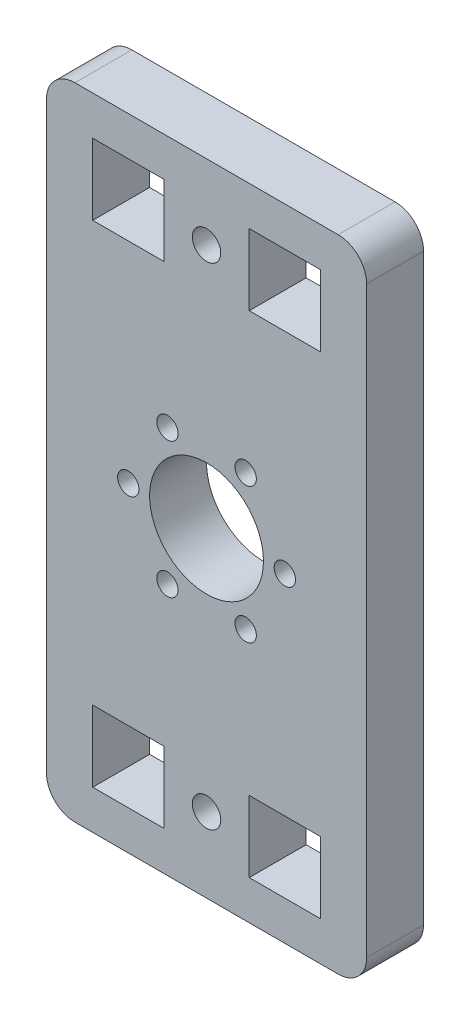
ISO-10303-21;
HEADER;
FILE_DESCRIPTION(('STEP AP214'),'2;1');
FILE_NAME('part.step','',(''),(''),'','','');
FILE_SCHEMA(('AUTOMOTIVE_DESIGN { 1 0 10303 214 1 1 1 1 }'));
ENDSEC;
DATA;
#1=APPLICATION_CONTEXT('core data for automotive mechanical design processes');
#2=APPLICATION_PROTOCOL_DEFINITION('international standard','automotive_design',2000,#1);
#3=PRODUCT_CONTEXT('',#1,'mechanical');
#4=PRODUCT('Part','Part','',(#3));
#5=PRODUCT_RELATED_PRODUCT_CATEGORY('part','',(#4));
#6=PRODUCT_DEFINITION_FORMATION('','',#4);
#7=PRODUCT_DEFINITION_CONTEXT('part definition',#1,'design');
#8=PRODUCT_DEFINITION('design','',#6,#7);
#9=PRODUCT_DEFINITION_SHAPE('','',#8);
#10=(LENGTH_UNIT() NAMED_UNIT(*) SI_UNIT(.MILLI.,.METRE.));
#11=(NAMED_UNIT(*) PLANE_ANGLE_UNIT() SI_UNIT($,.RADIAN.));
#12=(NAMED_UNIT(*) SI_UNIT($,.STERADIAN.) SOLID_ANGLE_UNIT());
#13=UNCERTAINTY_MEASURE_WITH_UNIT(LENGTH_MEASURE(1.E-05),#10,'distance_accuracy_value','');
#14=(GEOMETRIC_REPRESENTATION_CONTEXT(3) GLOBAL_UNCERTAINTY_ASSIGNED_CONTEXT((#13)) GLOBAL_UNIT_ASSIGNED_CONTEXT((#10,
#11,#12)) REPRESENTATION_CONTEXT('',''));
#15=CARTESIAN_POINT('',(0.,0.,0.));
#16=DIRECTION('',(0.,0.,1.));
#17=DIRECTION('',(1.,0.,0.));
#18=AXIS2_PLACEMENT_3D('',#15,#16,#17);
#19=CARTESIAN_POINT('',(18.5,-41.,8.));
#20=DIRECTION('',(0.,0.,1.));
#21=DIRECTION('',(1.,0.,0.));
#22=AXIS2_PLACEMENT_3D('',#19,#20,#21);
#23=PLANE('',#22);
#24=DIRECTION('',(0.,1.,0.));
#25=VECTOR('',#24,1.);
#26=CARTESIAN_POINT('',(16.,29.5,8.));
#27=LINE('',#26,#25);
#28=CARTESIAN_POINT('',(16.,29.5,8.));
#29=VERTEX_POINT('',#28);
#30=CARTESIAN_POINT('',(16.,39.5,8.));
#31=VERTEX_POINT('',#30);
#32=EDGE_CURVE('E246',#29,#31,#27,.T.);
#33=ORIENTED_EDGE('',*,*,#32,.F.);
#34=DIRECTION('',(1.,0.,0.));
#35=VECTOR('',#34,1.);
#36=CARTESIAN_POINT('',(16.,29.5,8.));
#37=LINE('',#36,#35);
#38=CARTESIAN_POINT('',(6.00000000000001,29.5,8.));
#39=VERTEX_POINT('',#38);
#40=EDGE_CURVE('E244',#39,#29,#37,.T.);
#41=ORIENTED_EDGE('',*,*,#40,.F.);
#42=DIRECTION('',(0.,-1.,0.));
#43=VECTOR('',#42,1.);
#44=CARTESIAN_POINT('',(6.00000000000001,29.5,8.));
#45=LINE('',#44,#43);
#46=CARTESIAN_POINT('',(6.00000000000001,39.5,8.));
#47=VERTEX_POINT('',#46);
#48=EDGE_CURVE('E252',#47,#39,#45,.T.);
#49=ORIENTED_EDGE('',*,*,#48,.F.);
#50=DIRECTION('',(-1.,0.,0.));
#51=VECTOR('',#50,1.);
#52=CARTESIAN_POINT('',(16.,39.5,8.));
#53=LINE('',#52,#51);
#54=EDGE_CURVE('E249',#31,#47,#53,.T.);
#55=ORIENTED_EDGE('',*,*,#54,.F.);
#56=EDGE_LOOP('',(#33,#41,#49,#55));
#57=FACE_BOUND('',#56,.T.);
#58=CARTESIAN_POINT('',(0.,-34.5,8.));
#59=DIRECTION('',(0.,0.,1.));
#60=DIRECTION('',(1.,0.,0.));
#61=AXIS2_PLACEMENT_3D('',#58,#59,#60);
#62=CIRCLE('',#61,2.00000000000001);
#63=CARTESIAN_POINT('',(2.00000000000001,-34.5,8.));
#64=VERTEX_POINT('',#63);
#65=EDGE_CURVE('E275',#64,#64,#62,.T.);
#66=ORIENTED_EDGE('',*,*,#65,.F.);
#67=EDGE_LOOP('',(#66));
#68=FACE_BOUND('',#67,.T.);
#69=CARTESIAN_POINT('',(5.50000000000001,-9.52627944162882,8.));
#70=DIRECTION('',(0.,0.,1.));
#71=DIRECTION('',(1.,0.,0.));
#72=AXIS2_PLACEMENT_3D('',#69,#70,#71);
#73=CIRCLE('',#72,1.5);
#74=CARTESIAN_POINT('',(7.,-9.52627944162882,8.));
#75=VERTEX_POINT('',#74);
#76=EDGE_CURVE('E287',#75,#75,#73,.T.);
#77=ORIENTED_EDGE('',*,*,#76,.F.);
#78=EDGE_LOOP('',(#77));
#79=FACE_BOUND('',#78,.T.);
#80=CARTESIAN_POINT('',(5.5,9.52627944162883,8.));
#81=DIRECTION('',(0.,0.,1.));
#82=DIRECTION('',(1.,0.,0.));
#83=AXIS2_PLACEMENT_3D('',#80,#81,#82);
#84=CIRCLE('',#83,1.5);
#85=CARTESIAN_POINT('',(7.,9.52627944162883,8.));
#86=VERTEX_POINT('',#85);
#87=EDGE_CURVE('E299',#86,#86,#84,.T.);
#88=ORIENTED_EDGE('',*,*,#87,.F.);
#89=EDGE_LOOP('',(#88));
#90=FACE_BOUND('',#89,.T.);
#91=CARTESIAN_POINT('',(0.,0.,8.));
#92=DIRECTION('',(0.,0.,1.));
#93=DIRECTION('',(1.,0.,0.));
#94=AXIS2_PLACEMENT_3D('',#91,#92,#93);
#95=CIRCLE('',#94,8.);
#96=CARTESIAN_POINT('',(8.,0.,8.));
#97=VERTEX_POINT('',#96);
#98=EDGE_CURVE('E311',#97,#97,#95,.T.);
#99=ORIENTED_EDGE('',*,*,#98,.F.);
#100=EDGE_LOOP('',(#99));
#101=FACE_BOUND('',#100,.T.);
#102=DIRECTION('',(-1.,0.,0.));
#103=VECTOR('',#102,1.);
#104=CARTESIAN_POINT('',(16.,-29.5,8.));
#105=LINE('',#104,#103);
#106=CARTESIAN_POINT('',(16.,-29.5,8.));
#107=VERTEX_POINT('',#106);
#108=CARTESIAN_POINT('',(6.,-29.5,8.));
#109=VERTEX_POINT('',#108);
#110=EDGE_CURVE('E325',#107,#109,#105,.T.);
#111=ORIENTED_EDGE('',*,*,#110,.F.);
#112=DIRECTION('',(0.,1.,0.));
#113=VECTOR('',#112,1.);
#114=CARTESIAN_POINT('',(16.,-29.5,8.));
#115=LINE('',#114,#113);
#116=CARTESIAN_POINT('',(16.,-39.5,8.));
#117=VERTEX_POINT('',#116);
#118=EDGE_CURVE('E323',#117,#107,#115,.T.);
#119=ORIENTED_EDGE('',*,*,#118,.F.);
#120=DIRECTION('',(1.,0.,0.));
#121=VECTOR('',#120,1.);
#122=CARTESIAN_POINT('',(16.,-39.5,8.));
#123=LINE('',#122,#121);
#124=CARTESIAN_POINT('',(6.00000000000001,-39.5,8.));
#125=VERTEX_POINT('',#124);
#126=EDGE_CURVE('E331',#125,#117,#123,.T.);
#127=ORIENTED_EDGE('',*,*,#126,.F.);
#128=DIRECTION('',(0.,-1.,0.));
#129=VECTOR('',#128,1.);
#130=CARTESIAN_POINT('',(6.,-29.5,8.));
#131=LINE('',#130,#129);
#132=EDGE_CURVE('E328',#109,#125,#131,.T.);
#133=ORIENTED_EDGE('',*,*,#132,.F.);
#134=EDGE_LOOP('',(#111,#119,#127,#133));
#135=FACE_BOUND('',#134,.T.);
#136=DIRECTION('',(1.,0.,0.));
#137=VECTOR('',#136,1.);
#138=CARTESIAN_POINT('',(-16.,-39.5,8.));
#139=LINE('',#138,#137);
#140=CARTESIAN_POINT('',(-16.,-39.5,8.));
#141=VERTEX_POINT('',#140);
#142=CARTESIAN_POINT('',(-5.99999999999999,-39.5,8.));
#143=VERTEX_POINT('',#142);
#144=EDGE_CURVE('E356',#141,#143,#139,.T.);
#145=ORIENTED_EDGE('',*,*,#144,.F.);
#146=DIRECTION('',(0.,-1.,0.));
#147=VECTOR('',#146,1.);
#148=CARTESIAN_POINT('',(-16.,-29.5,8.));
#149=LINE('',#148,#147);
#150=CARTESIAN_POINT('',(-16.,-29.5,8.));
#151=VERTEX_POINT('',#150);
#152=EDGE_CURVE('E354',#151,#141,#149,.T.);
#153=ORIENTED_EDGE('',*,*,#152,.F.);
#154=DIRECTION('',(-1.,0.,0.));
#155=VECTOR('',#154,1.);
#156=CARTESIAN_POINT('',(-16.,-29.5,8.));
#157=LINE('',#156,#155);
#158=CARTESIAN_POINT('',(-6.,-29.5,8.));
#159=VERTEX_POINT('',#158);
#160=EDGE_CURVE('E362',#159,#151,#157,.T.);
#161=ORIENTED_EDGE('',*,*,#160,.F.);
#162=DIRECTION('',(0.,1.,0.));
#163=VECTOR('',#162,1.);
#164=CARTESIAN_POINT('',(-6.,-29.5,8.));
#165=LINE('',#164,#163);
#166=EDGE_CURVE('E359',#143,#159,#165,.T.);
#167=ORIENTED_EDGE('',*,*,#166,.F.);
#168=EDGE_LOOP('',(#145,#153,#161,#167));
#169=FACE_BOUND('',#168,.T.);
#170=CARTESIAN_POINT('',(18.5,-41.,8.));
#171=DIRECTION('',(0.,0.,1.));
#172=DIRECTION('',(1.,0.,0.));
#173=AXIS2_PLACEMENT_3D('',#170,#171,#172);
#174=CIRCLE('',#173,4.);
#175=CARTESIAN_POINT('',(18.5,-45.,8.));
#176=VERTEX_POINT('',#175);
#177=CARTESIAN_POINT('',(22.5,-41.,8.));
#178=VERTEX_POINT('',#177);
#179=EDGE_CURVE('E385',#176,#178,#174,.T.);
#180=ORIENTED_EDGE('',*,*,#179,.T.);
#181=DIRECTION('',(0.,1.,0.));
#182=VECTOR('',#181,1.);
#183=CARTESIAN_POINT('',(22.5,-41.,8.));
#184=LINE('',#183,#182);
#185=CARTESIAN_POINT('',(22.5,41.,8.));
#186=VERTEX_POINT('',#185);
#187=EDGE_CURVE('E388',#178,#186,#184,.T.);
#188=ORIENTED_EDGE('',*,*,#187,.T.);
#189=CARTESIAN_POINT('',(18.5,41.,8.));
#190=DIRECTION('',(0.,0.,1.));
#191=DIRECTION('',(1.,0.,0.));
#192=AXIS2_PLACEMENT_3D('',#189,#190,#191);
#193=CIRCLE('',#192,4.);
#194=CARTESIAN_POINT('',(18.5,45.,8.));
#195=VERTEX_POINT('',#194);
#196=EDGE_CURVE('E391',#186,#195,#193,.T.);
#197=ORIENTED_EDGE('',*,*,#196,.T.);
#198=DIRECTION('',(-1.,0.,0.));
#199=VECTOR('',#198,1.);
#200=CARTESIAN_POINT('',(18.5,45.,8.));
#201=LINE('',#200,#199);
#202=CARTESIAN_POINT('',(-18.5,45.,8.));
#203=VERTEX_POINT('',#202);
#204=EDGE_CURVE('E393',#195,#203,#201,.T.);
#205=ORIENTED_EDGE('',*,*,#204,.T.);
#206=CARTESIAN_POINT('',(-18.5,41.,8.));
#207=DIRECTION('',(0.,0.,1.));
#208=DIRECTION('',(-1.,0.,0.));
#209=AXIS2_PLACEMENT_3D('',#206,#207,#208);
#210=CIRCLE('',#209,4.00000000000001);
#211=CARTESIAN_POINT('',(-22.5,41.,8.));
#212=VERTEX_POINT('',#211);
#213=EDGE_CURVE('E395',#203,#212,#210,.T.);
#214=ORIENTED_EDGE('',*,*,#213,.T.);
#215=DIRECTION('',(0.,-1.,0.));
#216=VECTOR('',#215,1.);
#217=CARTESIAN_POINT('',(-22.5,-41.,8.));
#218=LINE('',#217,#216);
#219=CARTESIAN_POINT('',(-22.5,-41.,8.));
#220=VERTEX_POINT('',#219);
#221=EDGE_CURVE('E397',#212,#220,#218,.T.);
#222=ORIENTED_EDGE('',*,*,#221,.T.);
#223=CARTESIAN_POINT('',(-18.5,-41.,8.));
#224=DIRECTION('',(0.,0.,1.));
#225=DIRECTION('',(1.,0.,0.));
#226=AXIS2_PLACEMENT_3D('',#223,#224,#225);
#227=CIRCLE('',#226,3.99999999999999);
#228=CARTESIAN_POINT('',(-18.5,-45.,8.));
#229=VERTEX_POINT('',#228);
#230=EDGE_CURVE('E399',#220,#229,#227,.T.);
#231=ORIENTED_EDGE('',*,*,#230,.T.);
#232=DIRECTION('',(1.,0.,0.));
#233=VECTOR('',#232,1.);
#234=CARTESIAN_POINT('',(18.5,-45.,8.));
#235=LINE('',#234,#233);
#236=EDGE_CURVE('E401',#229,#176,#235,.T.);
#237=ORIENTED_EDGE('',*,*,#236,.T.);
#238=EDGE_LOOP('',(#180,#188,#197,#205,#214,#222,#231,#237));
#239=FACE_BOUND('',#238,.T.);
#240=CARTESIAN_POINT('',(-11.,0.,8.));
#241=DIRECTION('',(0.,0.,1.));
#242=DIRECTION('',(1.,0.,0.));
#243=AXIS2_PLACEMENT_3D('',#240,#241,#242);
#244=CIRCLE('',#243,1.5);
#245=CARTESIAN_POINT('',(-9.5,0.,8.));
#246=VERTEX_POINT('',#245);
#247=EDGE_CURVE('E317',#246,#246,#244,.T.);
#248=ORIENTED_EDGE('',*,*,#247,.F.);
#249=EDGE_LOOP('',(#248));
#250=FACE_BOUND('',#249,.T.);
#251=CARTESIAN_POINT('',(-5.5,9.52627944162882,8.));
#252=DIRECTION('',(0.,0.,1.));
#253=DIRECTION('',(1.,0.,0.));
#254=AXIS2_PLACEMENT_3D('',#251,#252,#253);
#255=CIRCLE('',#254,1.5);
#256=CARTESIAN_POINT('',(-4.,9.52627944162882,8.));
#257=VERTEX_POINT('',#256);
#258=EDGE_CURVE('E305',#257,#257,#255,.T.);
#259=ORIENTED_EDGE('',*,*,#258,.F.);
#260=EDGE_LOOP('',(#259));
#261=FACE_BOUND('',#260,.T.);
#262=CARTESIAN_POINT('',(11.,0.,8.));
#263=DIRECTION('',(0.,0.,1.));
#264=DIRECTION('',(1.,0.,0.));
#265=AXIS2_PLACEMENT_3D('',#262,#263,#264);
#266=CIRCLE('',#265,1.5);
#267=CARTESIAN_POINT('',(12.5,0.,8.));
#268=VERTEX_POINT('',#267);
#269=EDGE_CURVE('E293',#268,#268,#266,.T.);
#270=ORIENTED_EDGE('',*,*,#269,.F.);
#271=EDGE_LOOP('',(#270));
#272=FACE_BOUND('',#271,.T.);
#273=CARTESIAN_POINT('',(-5.49999999999999,-9.52627944162883,8.));
#274=DIRECTION('',(0.,0.,1.));
#275=DIRECTION('',(1.,0.,0.));
#276=AXIS2_PLACEMENT_3D('',#273,#274,#275);
#277=CIRCLE('',#276,1.5);
#278=CARTESIAN_POINT('',(-3.99999999999999,-9.52627944162883,8.));
#279=VERTEX_POINT('',#278);
#280=EDGE_CURVE('E281',#279,#279,#277,.T.);
#281=ORIENTED_EDGE('',*,*,#280,.F.);
#282=EDGE_LOOP('',(#281));
#283=FACE_BOUND('',#282,.T.);
#284=CARTESIAN_POINT('',(0.,34.5,8.));
#285=DIRECTION('',(0.,0.,1.));
#286=DIRECTION('',(-1.,0.,0.));
#287=AXIS2_PLACEMENT_3D('',#284,#285,#286);
#288=CIRCLE('',#287,2.00000000000001);
#289=CARTESIAN_POINT('',(-2.,34.5,8.));
#290=VERTEX_POINT('',#289);
#291=EDGE_CURVE('E238',#290,#290,#288,.T.);
#292=ORIENTED_EDGE('',*,*,#291,.F.);
#293=EDGE_LOOP('',(#292));
#294=FACE_BOUND('',#293,.T.);
#295=DIRECTION('',(1.,0.,0.));
#296=VECTOR('',#295,1.);
#297=CARTESIAN_POINT('',(-16.,29.5,8.));
#298=LINE('',#297,#296);
#299=CARTESIAN_POINT('',(-16.,29.5,8.));
#300=VERTEX_POINT('',#299);
#301=CARTESIAN_POINT('',(-5.99999999999999,29.5,8.));
#302=VERTEX_POINT('',#301);
#303=EDGE_CURVE('E210',#300,#302,#298,.T.);
#304=ORIENTED_EDGE('',*,*,#303,.F.);
#305=DIRECTION('',(0.,-1.,0.));
#306=VECTOR('',#305,1.);
#307=CARTESIAN_POINT('',(-16.,29.5,8.));
#308=LINE('',#307,#306);
#309=CARTESIAN_POINT('',(-16.,39.5,8.));
#310=VERTEX_POINT('',#309);
#311=EDGE_CURVE('E202',#310,#300,#308,.T.);
#312=ORIENTED_EDGE('',*,*,#311,.F.);
#313=DIRECTION('',(-1.,0.,0.));
#314=VECTOR('',#313,1.);
#315=CARTESIAN_POINT('',(-16.,39.5,8.));
#316=LINE('',#315,#314);
#317=CARTESIAN_POINT('',(-5.99999999999999,39.5,8.));
#318=VERTEX_POINT('',#317);
#319=EDGE_CURVE('E224',#318,#310,#316,.T.);
#320=ORIENTED_EDGE('',*,*,#319,.F.);
#321=DIRECTION('',(0.,1.,0.));
#322=VECTOR('',#321,1.);
#323=CARTESIAN_POINT('',(-5.99999999999999,29.5,8.));
#324=LINE('',#323,#322);
#325=EDGE_CURVE('E222',#302,#318,#324,.T.);
#326=ORIENTED_EDGE('',*,*,#325,.F.);
#327=EDGE_LOOP('',(#304,#312,#320,#326));
#328=FACE_BOUND('',#327,.T.);
#329=ADVANCED_FACE('F41',(#57,#68,#79,#90,#101,#135,#169,#239,#250,#261,#272,#283,#294,#328),
#23,.T.);
#330=CARTESIAN_POINT('',(18.5,-41.,0.));
#331=DIRECTION('',(0.,0.,1.));
#332=DIRECTION('',(1.,0.,0.));
#333=AXIS2_PLACEMENT_3D('',#330,#331,#332);
#334=PLANE('',#333);
#335=CARTESIAN_POINT('',(0.,34.5,0.));
#336=DIRECTION('',(0.,0.,1.));
#337=DIRECTION('',(-1.,0.,0.));
#338=AXIS2_PLACEMENT_3D('',#335,#336,#337);
#339=CIRCLE('',#338,2.00000000000001);
#340=CARTESIAN_POINT('',(-2.,34.5,0.));
#341=VERTEX_POINT('',#340);
#342=EDGE_CURVE('E218',#341,#341,#339,.T.);
#343=ORIENTED_EDGE('',*,*,#342,.T.);
#344=EDGE_LOOP('',(#343));
#345=FACE_BOUND('',#344,.T.);
#346=DIRECTION('',(1.,0.,0.));
#347=VECTOR('',#346,1.);
#348=CARTESIAN_POINT('',(16.,29.5,0.));
#349=LINE('',#348,#347);
#350=CARTESIAN_POINT('',(6.00000000000001,29.5,0.));
#351=VERTEX_POINT('',#350);
#352=CARTESIAN_POINT('',(16.,29.5,0.));
#353=VERTEX_POINT('',#352);
#354=EDGE_CURVE('E241',#351,#353,#349,.T.);
#355=ORIENTED_EDGE('',*,*,#354,.T.);
#356=DIRECTION('',(0.,1.,0.));
#357=VECTOR('',#356,1.);
#358=CARTESIAN_POINT('',(16.,29.5,0.));
#359=LINE('',#358,#357);
#360=CARTESIAN_POINT('',(16.,39.5,0.));
#361=VERTEX_POINT('',#360);
#362=EDGE_CURVE('E257',#353,#361,#359,.T.);
#363=ORIENTED_EDGE('',*,*,#362,.T.);
#364=DIRECTION('',(-1.,0.,0.));
#365=VECTOR('',#364,1.);
#366=CARTESIAN_POINT('',(16.,39.5,0.));
#367=LINE('',#366,#365);
#368=CARTESIAN_POINT('',(6.00000000000001,39.5,0.));
#369=VERTEX_POINT('',#368);
#370=EDGE_CURVE('E260',#361,#369,#367,.T.);
#371=ORIENTED_EDGE('',*,*,#370,.T.);
#372=DIRECTION('',(0.,-1.,0.));
#373=VECTOR('',#372,1.);
#374=CARTESIAN_POINT('',(6.00000000000001,29.5,0.));
#375=LINE('',#374,#373);
#376=EDGE_CURVE('E247',#369,#351,#375,.T.);
#377=ORIENTED_EDGE('',*,*,#376,.T.);
#378=EDGE_LOOP('',(#355,#363,#371,#377));
#379=FACE_BOUND('',#378,.T.);
#380=DIRECTION('',(0.,-1.,0.));
#381=VECTOR('',#380,1.);
#382=CARTESIAN_POINT('',(-16.,-29.5,0.));
#383=LINE('',#382,#381);
#384=CARTESIAN_POINT('',(-16.,-29.5,0.));
#385=VERTEX_POINT('',#384);
#386=CARTESIAN_POINT('',(-16.,-39.5,0.));
#387=VERTEX_POINT('',#386);
#388=EDGE_CURVE('E353',#385,#387,#383,.T.);
#389=ORIENTED_EDGE('',*,*,#388,.T.);
#390=DIRECTION('',(1.,0.,0.));
#391=VECTOR('',#390,1.);
#392=CARTESIAN_POINT('',(-16.,-39.5,0.));
#393=LINE('',#392,#391);
#394=CARTESIAN_POINT('',(-5.99999999999999,-39.5,0.));
#395=VERTEX_POINT('',#394);
#396=EDGE_CURVE('E367',#387,#395,#393,.T.);
#397=ORIENTED_EDGE('',*,*,#396,.T.);
#398=DIRECTION('',(0.,1.,0.));
#399=VECTOR('',#398,1.);
#400=CARTESIAN_POINT('',(-6.,-29.5,0.));
#401=LINE('',#400,#399);
#402=CARTESIAN_POINT('',(-6.,-29.5,0.));
#403=VERTEX_POINT('',#402);
#404=EDGE_CURVE('E370',#395,#403,#401,.T.);
#405=ORIENTED_EDGE('',*,*,#404,.T.);
#406=DIRECTION('',(-1.,0.,0.));
#407=VECTOR('',#406,1.);
#408=CARTESIAN_POINT('',(-16.,-29.5,0.));
#409=LINE('',#408,#407);
#410=EDGE_CURVE('E357',#403,#385,#409,.T.);
#411=ORIENTED_EDGE('',*,*,#410,.T.);
#412=EDGE_LOOP('',(#389,#397,#405,#411));
#413=FACE_BOUND('',#412,.T.);
#414=CARTESIAN_POINT('',(18.5,-41.,0.));
#415=DIRECTION('',(0.,0.,1.));
#416=DIRECTION('',(1.,0.,0.));
#417=AXIS2_PLACEMENT_3D('',#414,#415,#416);
#418=CIRCLE('',#417,4.);
#419=CARTESIAN_POINT('',(18.5,-45.,0.));
#420=VERTEX_POINT('',#419);
#421=CARTESIAN_POINT('',(22.5,-41.,0.));
#422=VERTEX_POINT('',#421);
#423=EDGE_CURVE('E384',#420,#422,#418,.T.);
#424=ORIENTED_EDGE('',*,*,#423,.F.);
#425=DIRECTION('',(1.,0.,0.));
#426=VECTOR('',#425,1.);
#427=CARTESIAN_POINT('',(18.5,-45.,0.));
#428=LINE('',#427,#426);
#429=CARTESIAN_POINT('',(-18.5,-45.,0.));
#430=VERTEX_POINT('',#429);
#431=EDGE_CURVE('E389',#430,#420,#428,.T.);
#432=ORIENTED_EDGE('',*,*,#431,.F.);
#433=CARTESIAN_POINT('',(-18.5,-41.,0.));
#434=DIRECTION('',(0.,0.,1.));
#435=DIRECTION('',(1.,0.,0.));
#436=AXIS2_PLACEMENT_3D('',#433,#434,#435);
#437=CIRCLE('',#436,3.99999999999999);
#438=CARTESIAN_POINT('',(-22.5,-41.,0.));
#439=VERTEX_POINT('',#438);
#440=EDGE_CURVE('E416',#439,#430,#437,.T.);
#441=ORIENTED_EDGE('',*,*,#440,.F.);
#442=DIRECTION('',(0.,-1.,0.));
#443=VECTOR('',#442,1.);
#444=CARTESIAN_POINT('',(-22.5,-41.,0.));
#445=LINE('',#444,#443);
#446=CARTESIAN_POINT('',(-22.5,41.,0.));
#447=VERTEX_POINT('',#446);
#448=EDGE_CURVE('E414',#447,#439,#445,.T.);
#449=ORIENTED_EDGE('',*,*,#448,.F.);
#450=CARTESIAN_POINT('',(-18.5,41.,0.));
#451=DIRECTION('',(0.,0.,1.));
#452=DIRECTION('',(-1.,0.,0.));
#453=AXIS2_PLACEMENT_3D('',#450,#451,#452);
#454=CIRCLE('',#453,4.00000000000001);
#455=CARTESIAN_POINT('',(-18.5,45.,0.));
#456=VERTEX_POINT('',#455);
#457=EDGE_CURVE('E412',#456,#447,#454,.T.);
#458=ORIENTED_EDGE('',*,*,#457,.F.);
#459=DIRECTION('',(-1.,0.,0.));
#460=VECTOR('',#459,1.);
#461=CARTESIAN_POINT('',(18.5,45.,0.));
#462=LINE('',#461,#460);
#463=CARTESIAN_POINT('',(18.5,45.,0.));
#464=VERTEX_POINT('',#463);
#465=EDGE_CURVE('E410',#464,#456,#462,.T.);
#466=ORIENTED_EDGE('',*,*,#465,.F.);
#467=CARTESIAN_POINT('',(18.5,41.,0.));
#468=DIRECTION('',(0.,0.,1.));
#469=DIRECTION('',(1.,0.,0.));
#470=AXIS2_PLACEMENT_3D('',#467,#468,#469);
#471=CIRCLE('',#470,4.);
#472=CARTESIAN_POINT('',(22.5,41.,0.));
#473=VERTEX_POINT('',#472);
#474=EDGE_CURVE('E408',#473,#464,#471,.T.);
#475=ORIENTED_EDGE('',*,*,#474,.F.);
#476=DIRECTION('',(0.,1.,0.));
#477=VECTOR('',#476,1.);
#478=CARTESIAN_POINT('',(22.5,-41.,0.));
#479=LINE('',#478,#477);
#480=EDGE_CURVE('E406',#422,#473,#479,.T.);
#481=ORIENTED_EDGE('',*,*,#480,.F.);
#482=EDGE_LOOP('',(#424,#432,#441,#449,#458,#466,#475,#481));
#483=FACE_BOUND('',#482,.T.);
#484=DIRECTION('',(0.,1.,0.));
#485=VECTOR('',#484,1.);
#486=CARTESIAN_POINT('',(16.,-29.5,0.));
#487=LINE('',#486,#485);
#488=CARTESIAN_POINT('',(16.,-39.5,0.));
#489=VERTEX_POINT('',#488);
#490=CARTESIAN_POINT('',(16.,-29.5,0.));
#491=VERTEX_POINT('',#490);
#492=EDGE_CURVE('E320',#489,#491,#487,.T.);
#493=ORIENTED_EDGE('',*,*,#492,.T.);
#494=DIRECTION('',(-1.,0.,0.));
#495=VECTOR('',#494,1.);
#496=CARTESIAN_POINT('',(16.,-29.5,0.));
#497=LINE('',#496,#495);
#498=CARTESIAN_POINT('',(6.,-29.5,0.));
#499=VERTEX_POINT('',#498);
#500=EDGE_CURVE('E336',#491,#499,#497,.T.);
#501=ORIENTED_EDGE('',*,*,#500,.T.);
#502=DIRECTION('',(0.,-1.,0.));
#503=VECTOR('',#502,1.);
#504=CARTESIAN_POINT('',(6.,-29.5,0.));
#505=LINE('',#504,#503);
#506=CARTESIAN_POINT('',(6.00000000000001,-39.5,0.));
#507=VERTEX_POINT('',#506);
#508=EDGE_CURVE('E339',#499,#507,#505,.T.);
#509=ORIENTED_EDGE('',*,*,#508,.T.);
#510=DIRECTION('',(1.,0.,0.));
#511=VECTOR('',#510,1.);
#512=CARTESIAN_POINT('',(16.,-39.5,0.));
#513=LINE('',#512,#511);
#514=EDGE_CURVE('E326',#507,#489,#513,.T.);
#515=ORIENTED_EDGE('',*,*,#514,.T.);
#516=EDGE_LOOP('',(#493,#501,#509,#515));
#517=FACE_BOUND('',#516,.T.);
#518=CARTESIAN_POINT('',(-11.,0.,0.));
#519=DIRECTION('',(0.,0.,1.));
#520=DIRECTION('',(1.,0.,0.));
#521=AXIS2_PLACEMENT_3D('',#518,#519,#520);
#522=CIRCLE('',#521,1.5);
#523=CARTESIAN_POINT('',(-9.5,0.,0.));
#524=VERTEX_POINT('',#523);
#525=EDGE_CURVE('E314',#524,#524,#522,.T.);
#526=ORIENTED_EDGE('',*,*,#525,.T.);
#527=EDGE_LOOP('',(#526));
#528=FACE_BOUND('',#527,.T.);
#529=CARTESIAN_POINT('',(0.,0.,0.));
#530=DIRECTION('',(0.,0.,1.));
#531=DIRECTION('',(1.,0.,0.));
#532=AXIS2_PLACEMENT_3D('',#529,#530,#531);
#533=CIRCLE('',#532,8.);
#534=CARTESIAN_POINT('',(8.,0.,0.));
#535=VERTEX_POINT('',#534);
#536=EDGE_CURVE('E308',#535,#535,#533,.T.);
#537=ORIENTED_EDGE('',*,*,#536,.T.);
#538=EDGE_LOOP('',(#537));
#539=FACE_BOUND('',#538,.T.);
#540=CARTESIAN_POINT('',(-5.5,9.52627944162882,0.));
#541=DIRECTION('',(0.,0.,1.));
#542=DIRECTION('',(1.,0.,0.));
#543=AXIS2_PLACEMENT_3D('',#540,#541,#542);
#544=CIRCLE('',#543,1.5);
#545=CARTESIAN_POINT('',(-4.,9.52627944162882,0.));
#546=VERTEX_POINT('',#545);
#547=EDGE_CURVE('E302',#546,#546,#544,.T.);
#548=ORIENTED_EDGE('',*,*,#547,.T.);
#549=EDGE_LOOP('',(#548));
#550=FACE_BOUND('',#549,.T.);
#551=CARTESIAN_POINT('',(5.5,9.52627944162883,0.));
#552=DIRECTION('',(0.,0.,1.));
#553=DIRECTION('',(1.,0.,0.));
#554=AXIS2_PLACEMENT_3D('',#551,#552,#553);
#555=CIRCLE('',#554,1.5);
#556=CARTESIAN_POINT('',(7.,9.52627944162883,0.));
#557=VERTEX_POINT('',#556);
#558=EDGE_CURVE('E296',#557,#557,#555,.T.);
#559=ORIENTED_EDGE('',*,*,#558,.T.);
#560=EDGE_LOOP('',(#559));
#561=FACE_BOUND('',#560,.T.);
#562=CARTESIAN_POINT('',(11.,0.,0.));
#563=DIRECTION('',(0.,0.,1.));
#564=DIRECTION('',(1.,0.,0.));
#565=AXIS2_PLACEMENT_3D('',#562,#563,#564);
#566=CIRCLE('',#565,1.5);
#567=CARTESIAN_POINT('',(12.5,0.,0.));
#568=VERTEX_POINT('',#567);
#569=EDGE_CURVE('E290',#568,#568,#566,.T.);
#570=ORIENTED_EDGE('',*,*,#569,.T.);
#571=EDGE_LOOP('',(#570));
#572=FACE_BOUND('',#571,.T.);
#573=CARTESIAN_POINT('',(5.50000000000001,-9.52627944162882,0.));
#574=DIRECTION('',(0.,0.,1.));
#575=DIRECTION('',(1.,0.,0.));
#576=AXIS2_PLACEMENT_3D('',#573,#574,#575);
#577=CIRCLE('',#576,1.5);
#578=CARTESIAN_POINT('',(7.,-9.52627944162882,0.));
#579=VERTEX_POINT('',#578);
#580=EDGE_CURVE('E284',#579,#579,#577,.T.);
#581=ORIENTED_EDGE('',*,*,#580,.T.);
#582=EDGE_LOOP('',(#581));
#583=FACE_BOUND('',#582,.T.);
#584=CARTESIAN_POINT('',(-5.49999999999999,-9.52627944162883,0.));
#585=DIRECTION('',(0.,0.,1.));
#586=DIRECTION('',(1.,0.,0.));
#587=AXIS2_PLACEMENT_3D('',#584,#585,#586);
#588=CIRCLE('',#587,1.5);
#589=CARTESIAN_POINT('',(-3.99999999999999,-9.52627944162883,0.));
#590=VERTEX_POINT('',#589);
#591=EDGE_CURVE('E278',#590,#590,#588,.T.);
#592=ORIENTED_EDGE('',*,*,#591,.T.);
#593=EDGE_LOOP('',(#592));
#594=FACE_BOUND('',#593,.T.);
#595=CARTESIAN_POINT('',(0.,-34.5,0.));
#596=DIRECTION('',(0.,0.,1.));
#597=DIRECTION('',(1.,0.,0.));
#598=AXIS2_PLACEMENT_3D('',#595,#596,#597);
#599=CIRCLE('',#598,2.00000000000001);
#600=CARTESIAN_POINT('',(2.00000000000001,-34.5,0.));
#601=VERTEX_POINT('',#600);
#602=EDGE_CURVE('E274',#601,#601,#599,.T.);
#603=ORIENTED_EDGE('',*,*,#602,.T.);
#604=EDGE_LOOP('',(#603));
#605=FACE_BOUND('',#604,.T.);
#606=DIRECTION('',(0.,-1.,0.));
#607=VECTOR('',#606,1.);
#608=CARTESIAN_POINT('',(-16.,29.5,0.));
#609=LINE('',#608,#607);
#610=CARTESIAN_POINT('',(-16.,39.5,0.));
#611=VERTEX_POINT('',#610);
#612=CARTESIAN_POINT('',(-16.,29.5,0.));
#613=VERTEX_POINT('',#612);
#614=EDGE_CURVE('E64',#611,#613,#609,.T.);
#615=ORIENTED_EDGE('',*,*,#614,.T.);
#616=DIRECTION('',(1.,0.,0.));
#617=VECTOR('',#616,1.);
#618=CARTESIAN_POINT('',(-16.,29.5,0.));
#619=LINE('',#618,#617);
#620=CARTESIAN_POINT('',(-5.99999999999999,29.5,0.));
#621=VERTEX_POINT('',#620);
#622=EDGE_CURVE('E217',#613,#621,#619,.T.);
#623=ORIENTED_EDGE('',*,*,#622,.T.);
#624=DIRECTION('',(0.,1.,0.));
#625=VECTOR('',#624,1.);
#626=CARTESIAN_POINT('',(-5.99999999999999,29.5,0.));
#627=LINE('',#626,#625);
#628=CARTESIAN_POINT('',(-5.99999999999999,39.5,0.));
#629=VERTEX_POINT('',#628);
#630=EDGE_CURVE('E230',#621,#629,#627,.T.);
#631=ORIENTED_EDGE('',*,*,#630,.T.);
#632=DIRECTION('',(-1.,0.,0.));
#633=VECTOR('',#632,1.);
#634=CARTESIAN_POINT('',(-16.,39.5,0.));
#635=LINE('',#634,#633);
#636=EDGE_CURVE('E211',#629,#611,#635,.T.);
#637=ORIENTED_EDGE('',*,*,#636,.T.);
#638=EDGE_LOOP('',(#615,#623,#631,#637));
#639=FACE_BOUND('',#638,.T.);
#640=ADVANCED_FACE('F446',(#345,#379,#413,#483,#517,#528,#539,#550,#561,#572,#583,#594,#605,
#639),#334,.F.);
#641=CARTESIAN_POINT('',(18.5,-41.,8.));
#642=DIRECTION('',(0.,0.,-1.));
#643=DIRECTION('',(-1.,0.,0.));
#644=AXIS2_PLACEMENT_3D('',#641,#642,#643);
#645=CYLINDRICAL_SURFACE('',#644,4.);
#646=ORIENTED_EDGE('',*,*,#423,.T.);
#647=DIRECTION('',(0.,0.,-1.));
#648=VECTOR('',#647,1.);
#649=CARTESIAN_POINT('',(22.5,-41.,8.));
#650=LINE('',#649,#648);
#651=EDGE_CURVE('E11',#178,#422,#650,.T.);
#652=ORIENTED_EDGE('',*,*,#651,.F.);
#653=ORIENTED_EDGE('',*,*,#179,.F.);
#654=DIRECTION('',(0.,0.,-1.));
#655=VECTOR('',#654,1.);
#656=CARTESIAN_POINT('',(18.5,-45.,8.));
#657=LINE('',#656,#655);
#658=EDGE_CURVE('E403',#176,#420,#657,.T.);
#659=ORIENTED_EDGE('',*,*,#658,.T.);
#660=EDGE_LOOP('',(#646,#652,#653,#659));
#661=FACE_BOUND('',#660,.T.);
#662=ADVANCED_FACE('F43',(#661),#645,.T.);
#663=CARTESIAN_POINT('',(22.5,-41.,8.));
#664=DIRECTION('',(-1.,0.,0.));
#665=DIRECTION('',(0.,-1.,0.));
#666=AXIS2_PLACEMENT_3D('',#663,#664,#665);
#667=PLANE('',#666);
#668=ORIENTED_EDGE('',*,*,#480,.T.);
#669=DIRECTION('',(0.,0.,-1.));
#670=VECTOR('',#669,1.);
#671=CARTESIAN_POINT('',(22.5,41.,8.));
#672=LINE('',#671,#670);
#673=EDGE_CURVE('E49',#186,#473,#672,.T.);
#674=ORIENTED_EDGE('',*,*,#673,.F.);
#675=ORIENTED_EDGE('',*,*,#187,.F.);
#676=ORIENTED_EDGE('',*,*,#651,.T.);
#677=EDGE_LOOP('',(#668,#674,#675,#676));
#678=FACE_BOUND('',#677,.T.);
#679=ADVANCED_FACE('F464',(#678),#667,.F.);
#680=CARTESIAN_POINT('',(18.5,41.,8.));
#681=DIRECTION('',(0.,0.,-1.));
#682=DIRECTION('',(-1.,0.,0.));
#683=AXIS2_PLACEMENT_3D('',#680,#681,#682);
#684=CYLINDRICAL_SURFACE('',#683,4.);
#685=ORIENTED_EDGE('',*,*,#474,.T.);
#686=DIRECTION('',(0.,0.,-1.));
#687=VECTOR('',#686,1.);
#688=CARTESIAN_POINT('',(18.5,45.,8.));
#689=LINE('',#688,#687);
#690=EDGE_CURVE('E433',#195,#464,#689,.T.);
#691=ORIENTED_EDGE('',*,*,#690,.F.);
#692=ORIENTED_EDGE('',*,*,#196,.F.);
#693=ORIENTED_EDGE('',*,*,#673,.T.);
#694=EDGE_LOOP('',(#685,#691,#692,#693));
#695=FACE_BOUND('',#694,.T.);
#696=ADVANCED_FACE('F440',(#695),#684,.T.);
#697=CARTESIAN_POINT('',(18.5,45.,8.));
#698=DIRECTION('',(0.,-1.,0.));
#699=DIRECTION('',(1.,0.,0.));
#700=AXIS2_PLACEMENT_3D('',#697,#698,#699);
#701=PLANE('',#700);
#702=ORIENTED_EDGE('',*,*,#465,.T.);
#703=DIRECTION('',(0.,0.,-1.));
#704=VECTOR('',#703,1.);
#705=CARTESIAN_POINT('',(-18.5,45.,8.));
#706=LINE('',#705,#704);
#707=EDGE_CURVE('E430',#203,#456,#706,.T.);
#708=ORIENTED_EDGE('',*,*,#707,.F.);
#709=ORIENTED_EDGE('',*,*,#204,.F.);
#710=ORIENTED_EDGE('',*,*,#690,.T.);
#711=EDGE_LOOP('',(#702,#708,#709,#710));
#712=FACE_BOUND('',#711,.T.);
#713=ADVANCED_FACE('F452',(#712),#701,.F.);
#714=CARTESIAN_POINT('',(-18.5,41.,8.));
#715=DIRECTION('',(0.,0.,-1.));
#716=DIRECTION('',(-1.,0.,0.));
#717=AXIS2_PLACEMENT_3D('',#714,#715,#716);
#718=CYLINDRICAL_SURFACE('',#717,4.00000000000001);
#719=ORIENTED_EDGE('',*,*,#457,.T.);
#720=DIRECTION('',(0.,0.,-1.));
#721=VECTOR('',#720,1.);
#722=CARTESIAN_POINT('',(-22.5,41.,8.));
#723=LINE('',#722,#721);
#724=EDGE_CURVE('E427',#212,#447,#723,.T.);
#725=ORIENTED_EDGE('',*,*,#724,.F.);
#726=ORIENTED_EDGE('',*,*,#213,.F.);
#727=ORIENTED_EDGE('',*,*,#707,.T.);
#728=EDGE_LOOP('',(#719,#725,#726,#727));
#729=FACE_BOUND('',#728,.T.);
#730=ADVANCED_FACE('F456',(#729),#718,.T.);
#731=CARTESIAN_POINT('',(-22.5,-41.,8.));
#732=DIRECTION('',(1.,0.,0.));
#733=DIRECTION('',(0.,1.,0.));
#734=AXIS2_PLACEMENT_3D('',#731,#732,#733);
#735=PLANE('',#734);
#736=ORIENTED_EDGE('',*,*,#448,.T.);
#737=DIRECTION('',(0.,0.,-1.));
#738=VECTOR('',#737,1.);
#739=CARTESIAN_POINT('',(-22.5,-41.,8.));
#740=LINE('',#739,#738);
#741=EDGE_CURVE('E424',#220,#439,#740,.T.);
#742=ORIENTED_EDGE('',*,*,#741,.F.);
#743=ORIENTED_EDGE('',*,*,#221,.F.);
#744=ORIENTED_EDGE('',*,*,#724,.T.);
#745=EDGE_LOOP('',(#736,#742,#743,#744));
#746=FACE_BOUND('',#745,.T.);
#747=ADVANCED_FACE('F477',(#746),#735,.F.);
#748=CARTESIAN_POINT('',(-18.5,-41.,8.));
#749=DIRECTION('',(0.,0.,-1.));
#750=DIRECTION('',(-1.,0.,0.));
#751=AXIS2_PLACEMENT_3D('',#748,#749,#750);
#752=CYLINDRICAL_SURFACE('',#751,3.99999999999999);
#753=ORIENTED_EDGE('',*,*,#440,.T.);
#754=DIRECTION('',(0.,0.,-1.));
#755=VECTOR('',#754,1.);
#756=CARTESIAN_POINT('',(-18.5,-45.,8.));
#757=LINE('',#756,#755);
#758=EDGE_CURVE('E421',#229,#430,#757,.T.);
#759=ORIENTED_EDGE('',*,*,#758,.F.);
#760=ORIENTED_EDGE('',*,*,#230,.F.);
#761=ORIENTED_EDGE('',*,*,#741,.T.);
#762=EDGE_LOOP('',(#753,#759,#760,#761));
#763=FACE_BOUND('',#762,.T.);
#764=ADVANCED_FACE('F475',(#763),#752,.T.);
#765=CARTESIAN_POINT('',(18.5,-45.,8.));
#766=DIRECTION('',(0.,1.,0.));
#767=DIRECTION('',(-1.,0.,0.));
#768=AXIS2_PLACEMENT_3D('',#765,#766,#767);
#769=PLANE('',#768);
#770=ORIENTED_EDGE('',*,*,#431,.T.);
#771=ORIENTED_EDGE('',*,*,#658,.F.);
#772=ORIENTED_EDGE('',*,*,#236,.F.);
#773=ORIENTED_EDGE('',*,*,#758,.T.);
#774=EDGE_LOOP('',(#770,#771,#772,#773));
#775=FACE_BOUND('',#774,.T.);
#776=ADVANCED_FACE('F470',(#775),#769,.F.);
#777=CARTESIAN_POINT('',(-16.,-29.5,8.));
#778=DIRECTION('',(1.,0.,0.));
#779=DIRECTION('',(0.,0.,-1.));
#780=AXIS2_PLACEMENT_3D('',#777,#778,#779);
#781=PLANE('',#780);
#782=ORIENTED_EDGE('',*,*,#388,.F.);
#783=DIRECTION('',(0.,0.,-1.));
#784=VECTOR('',#783,1.);
#785=CARTESIAN_POINT('',(-16.,-29.5,8.));
#786=LINE('',#785,#784);
#787=EDGE_CURVE('E364',#151,#385,#786,.T.);
#788=ORIENTED_EDGE('',*,*,#787,.F.);
#789=ORIENTED_EDGE('',*,*,#152,.T.);
#790=DIRECTION('',(0.,0.,-1.));
#791=VECTOR('',#790,1.);
#792=CARTESIAN_POINT('',(-16.,-39.5,8.));
#793=LINE('',#792,#791);
#794=EDGE_CURVE('E381',#141,#387,#793,.T.);
#795=ORIENTED_EDGE('',*,*,#794,.T.);
#796=EDGE_LOOP('',(#782,#788,#789,#795));
#797=FACE_BOUND('',#796,.T.);
#798=ADVANCED_FACE('F497',(#797),#781,.T.);
#799=CARTESIAN_POINT('',(-16.,-39.5,8.));
#800=DIRECTION('',(0.,1.,0.));
#801=DIRECTION('',(0.,0.,1.));
#802=AXIS2_PLACEMENT_3D('',#799,#800,#801);
#803=PLANE('',#802);
#804=ORIENTED_EDGE('',*,*,#396,.F.);
#805=ORIENTED_EDGE('',*,*,#794,.F.);
#806=ORIENTED_EDGE('',*,*,#144,.T.);
#807=DIRECTION('',(0.,0.,-1.));
#808=VECTOR('',#807,1.);
#809=CARTESIAN_POINT('',(-5.99999999999999,-39.5,8.));
#810=LINE('',#809,#808);
#811=EDGE_CURVE('E379',#143,#395,#810,.T.);
#812=ORIENTED_EDGE('',*,*,#811,.T.);
#813=EDGE_LOOP('',(#804,#805,#806,#812));
#814=FACE_BOUND('',#813,.T.);
#815=ADVANCED_FACE('F504',(#814),#803,.T.);
#816=CARTESIAN_POINT('',(-6.,-29.5,8.));
#817=DIRECTION('',(-1.,0.,0.));
#818=DIRECTION('',(0.,-1.,0.));
#819=AXIS2_PLACEMENT_3D('',#816,#817,#818);
#820=PLANE('',#819);
#821=ORIENTED_EDGE('',*,*,#404,.F.);
#822=ORIENTED_EDGE('',*,*,#811,.F.);
#823=ORIENTED_EDGE('',*,*,#166,.T.);
#824=DIRECTION('',(0.,0.,-1.));
#825=VECTOR('',#824,1.);
#826=CARTESIAN_POINT('',(-6.,-29.5,8.));
#827=LINE('',#826,#825);
#828=EDGE_CURVE('E377',#159,#403,#827,.T.);
#829=ORIENTED_EDGE('',*,*,#828,.T.);
#830=EDGE_LOOP('',(#821,#822,#823,#829));
#831=FACE_BOUND('',#830,.T.);
#832=ADVANCED_FACE('F509',(#831),#820,.T.);
#833=CARTESIAN_POINT('',(-16.,-29.5,8.));
#834=DIRECTION('',(0.,-1.,0.));
#835=DIRECTION('',(0.,0.,-1.));
#836=AXIS2_PLACEMENT_3D('',#833,#834,#835);
#837=PLANE('',#836);
#838=ORIENTED_EDGE('',*,*,#410,.F.);
#839=ORIENTED_EDGE('',*,*,#828,.F.);
#840=ORIENTED_EDGE('',*,*,#160,.T.);
#841=ORIENTED_EDGE('',*,*,#787,.T.);
#842=EDGE_LOOP('',(#838,#839,#840,#841));
#843=FACE_BOUND('',#842,.T.);
#844=ADVANCED_FACE('F517',(#843),#837,.T.);
#845=CARTESIAN_POINT('',(16.,-29.5,8.));
#846=DIRECTION('',(-1.,0.,0.));
#847=DIRECTION('',(0.,0.,1.));
#848=AXIS2_PLACEMENT_3D('',#845,#846,#847);
#849=PLANE('',#848);
#850=ORIENTED_EDGE('',*,*,#492,.F.);
#851=DIRECTION('',(0.,0.,-1.));
#852=VECTOR('',#851,1.);
#853=CARTESIAN_POINT('',(16.,-39.5,8.));
#854=LINE('',#853,#852);
#855=EDGE_CURVE('E333',#117,#489,#854,.T.);
#856=ORIENTED_EDGE('',*,*,#855,.F.);
#857=ORIENTED_EDGE('',*,*,#118,.T.);
#858=DIRECTION('',(0.,0.,-1.));
#859=VECTOR('',#858,1.);
#860=CARTESIAN_POINT('',(16.,-29.5,8.));
#861=LINE('',#860,#859);
#862=EDGE_CURVE('E350',#107,#491,#861,.T.);
#863=ORIENTED_EDGE('',*,*,#862,.T.);
#864=EDGE_LOOP('',(#850,#856,#857,#863));
#865=FACE_BOUND('',#864,.T.);
#866=ADVANCED_FACE('F530',(#865),#849,.T.);
#867=CARTESIAN_POINT('',(16.,-29.5,8.));
#868=DIRECTION('',(0.,-1.,0.));
#869=DIRECTION('',(1.,0.,0.));
#870=AXIS2_PLACEMENT_3D('',#867,#868,#869);
#871=PLANE('',#870);
#872=ORIENTED_EDGE('',*,*,#500,.F.);
#873=ORIENTED_EDGE('',*,*,#862,.F.);
#874=ORIENTED_EDGE('',*,*,#110,.T.);
#875=DIRECTION('',(0.,0.,-1.));
#876=VECTOR('',#875,1.);
#877=CARTESIAN_POINT('',(6.,-29.5,8.));
#878=LINE('',#877,#876);
#879=EDGE_CURVE('E348',#109,#499,#878,.T.);
#880=ORIENTED_EDGE('',*,*,#879,.T.);
#881=EDGE_LOOP('',(#872,#873,#874,#880));
#882=FACE_BOUND('',#881,.T.);
#883=ADVANCED_FACE('F535',(#882),#871,.T.);
#884=CARTESIAN_POINT('',(6.,-29.5,8.));
#885=DIRECTION('',(1.,0.,0.));
#886=DIRECTION('',(0.,1.,0.));
#887=AXIS2_PLACEMENT_3D('',#884,#885,#886);
#888=PLANE('',#887);
#889=ORIENTED_EDGE('',*,*,#508,.F.);
#890=ORIENTED_EDGE('',*,*,#879,.F.);
#891=ORIENTED_EDGE('',*,*,#132,.T.);
#892=DIRECTION('',(0.,0.,-1.));
#893=VECTOR('',#892,1.);
#894=CARTESIAN_POINT('',(6.00000000000001,-39.5,8.));
#895=LINE('',#894,#893);
#896=EDGE_CURVE('E346',#125,#507,#895,.T.);
#897=ORIENTED_EDGE('',*,*,#896,.T.);
#898=EDGE_LOOP('',(#889,#890,#891,#897));
#899=FACE_BOUND('',#898,.T.);
#900=ADVANCED_FACE('F539',(#899),#888,.T.);
#901=CARTESIAN_POINT('',(16.,-39.5,8.));
#902=DIRECTION('',(0.,1.,0.));
#903=DIRECTION('',(-1.,0.,0.));
#904=AXIS2_PLACEMENT_3D('',#901,#902,#903);
#905=PLANE('',#904);
#906=ORIENTED_EDGE('',*,*,#514,.F.);
#907=ORIENTED_EDGE('',*,*,#896,.F.);
#908=ORIENTED_EDGE('',*,*,#126,.T.);
#909=ORIENTED_EDGE('',*,*,#855,.T.);
#910=EDGE_LOOP('',(#906,#907,#908,#909));
#911=FACE_BOUND('',#910,.T.);
#912=ADVANCED_FACE('F543',(#911),#905,.T.);
#913=CARTESIAN_POINT('',(-11.,0.,8.));
#914=DIRECTION('',(0.,0.,-1.));
#915=DIRECTION('',(-1.,0.,0.));
#916=AXIS2_PLACEMENT_3D('',#913,#914,#915);
#917=CYLINDRICAL_SURFACE('',#916,1.5);
#918=ORIENTED_EDGE('',*,*,#247,.T.);
#919=EDGE_LOOP('',(#918));
#920=FACE_BOUND('',#919,.T.);
#921=ORIENTED_EDGE('',*,*,#525,.F.);
#922=EDGE_LOOP('',(#921));
#923=FACE_BOUND('',#922,.T.);
#924=ADVANCED_FACE('F547',(#920,#923),#917,.F.);
#925=CARTESIAN_POINT('',(0.,0.,8.));
#926=DIRECTION('',(0.,0.,-1.));
#927=DIRECTION('',(-1.,0.,0.));
#928=AXIS2_PLACEMENT_3D('',#925,#926,#927);
#929=CYLINDRICAL_SURFACE('',#928,8.);
#930=ORIENTED_EDGE('',*,*,#98,.T.);
#931=EDGE_LOOP('',(#930));
#932=FACE_BOUND('',#931,.T.);
#933=ORIENTED_EDGE('',*,*,#536,.F.);
#934=EDGE_LOOP('',(#933));
#935=FACE_BOUND('',#934,.T.);
#936=ADVANCED_FACE('F551',(#932,#935),#929,.F.);
#937=CARTESIAN_POINT('',(-5.5,9.52627944162882,8.));
#938=DIRECTION('',(0.,0.,-1.));
#939=DIRECTION('',(-1.,0.,0.));
#940=AXIS2_PLACEMENT_3D('',#937,#938,#939);
#941=CYLINDRICAL_SURFACE('',#940,1.5);
#942=ORIENTED_EDGE('',*,*,#258,.T.);
#943=EDGE_LOOP('',(#942));
#944=FACE_BOUND('',#943,.T.);
#945=ORIENTED_EDGE('',*,*,#547,.F.);
#946=EDGE_LOOP('',(#945));
#947=FACE_BOUND('',#946,.T.);
#948=ADVANCED_FACE('F555',(#944,#947),#941,.F.);
#949=CARTESIAN_POINT('',(5.5,9.52627944162883,8.));
#950=DIRECTION('',(0.,0.,-1.));
#951=DIRECTION('',(-1.,0.,0.));
#952=AXIS2_PLACEMENT_3D('',#949,#950,#951);
#953=CYLINDRICAL_SURFACE('',#952,1.5);
#954=ORIENTED_EDGE('',*,*,#87,.T.);
#955=EDGE_LOOP('',(#954));
#956=FACE_BOUND('',#955,.T.);
#957=ORIENTED_EDGE('',*,*,#558,.F.);
#958=EDGE_LOOP('',(#957));
#959=FACE_BOUND('',#958,.T.);
#960=ADVANCED_FACE('F559',(#956,#959),#953,.F.);
#961=CARTESIAN_POINT('',(11.,0.,8.));
#962=DIRECTION('',(0.,0.,-1.));
#963=DIRECTION('',(-1.,0.,0.));
#964=AXIS2_PLACEMENT_3D('',#961,#962,#963);
#965=CYLINDRICAL_SURFACE('',#964,1.5);
#966=ORIENTED_EDGE('',*,*,#269,.T.);
#967=EDGE_LOOP('',(#966));
#968=FACE_BOUND('',#967,.T.);
#969=ORIENTED_EDGE('',*,*,#569,.F.);
#970=EDGE_LOOP('',(#969));
#971=FACE_BOUND('',#970,.T.);
#972=ADVANCED_FACE('F563',(#968,#971),#965,.F.);
#973=CARTESIAN_POINT('',(5.50000000000001,-9.52627944162882,8.));
#974=DIRECTION('',(0.,0.,-1.));
#975=DIRECTION('',(-1.,0.,0.));
#976=AXIS2_PLACEMENT_3D('',#973,#974,#975);
#977=CYLINDRICAL_SURFACE('',#976,1.5);
#978=ORIENTED_EDGE('',*,*,#76,.T.);
#979=EDGE_LOOP('',(#978));
#980=FACE_BOUND('',#979,.T.);
#981=ORIENTED_EDGE('',*,*,#580,.F.);
#982=EDGE_LOOP('',(#981));
#983=FACE_BOUND('',#982,.T.);
#984=ADVANCED_FACE('F567',(#980,#983),#977,.F.);
#985=CARTESIAN_POINT('',(-5.49999999999999,-9.52627944162883,8.));
#986=DIRECTION('',(0.,0.,-1.));
#987=DIRECTION('',(-1.,0.,0.));
#988=AXIS2_PLACEMENT_3D('',#985,#986,#987);
#989=CYLINDRICAL_SURFACE('',#988,1.5);
#990=ORIENTED_EDGE('',*,*,#280,.T.);
#991=EDGE_LOOP('',(#990));
#992=FACE_BOUND('',#991,.T.);
#993=ORIENTED_EDGE('',*,*,#591,.F.);
#994=EDGE_LOOP('',(#993));
#995=FACE_BOUND('',#994,.T.);
#996=ADVANCED_FACE('F571',(#992,#995),#989,.F.);
#997=CARTESIAN_POINT('',(0.,-34.5,8.));
#998=DIRECTION('',(0.,0.,-1.));
#999=DIRECTION('',(-1.,0.,0.));
#1000=AXIS2_PLACEMENT_3D('',#997,#998,#999);
#1001=CYLINDRICAL_SURFACE('',#1000,2.00000000000001);
#1002=ORIENTED_EDGE('',*,*,#65,.T.);
#1003=EDGE_LOOP('',(#1002));
#1004=FACE_BOUND('',#1003,.T.);
#1005=ORIENTED_EDGE('',*,*,#602,.F.);
#1006=EDGE_LOOP('',(#1005));
#1007=FACE_BOUND('',#1006,.T.);
#1008=ADVANCED_FACE('F575',(#1004,#1007),#1001,.F.);
#1009=CARTESIAN_POINT('',(16.,29.5,8.));
#1010=DIRECTION('',(0.,1.,0.));
#1011=DIRECTION('',(-1.,0.,0.));
#1012=AXIS2_PLACEMENT_3D('',#1009,#1010,#1011);
#1013=PLANE('',#1012);
#1014=ORIENTED_EDGE('',*,*,#354,.F.);
#1015=DIRECTION('',(0.,0.,-1.));
#1016=VECTOR('',#1015,1.);
#1017=CARTESIAN_POINT('',(6.00000000000001,29.5,8.));
#1018=LINE('',#1017,#1016);
#1019=EDGE_CURVE('E254',#39,#351,#1018,.T.);
#1020=ORIENTED_EDGE('',*,*,#1019,.F.);
#1021=ORIENTED_EDGE('',*,*,#40,.T.);
#1022=DIRECTION('',(0.,0.,-1.));
#1023=VECTOR('',#1022,1.);
#1024=CARTESIAN_POINT('',(16.,29.5,8.));
#1025=LINE('',#1024,#1023);
#1026=EDGE_CURVE('E271',#29,#353,#1025,.T.);
#1027=ORIENTED_EDGE('',*,*,#1026,.T.);
#1028=EDGE_LOOP('',(#1014,#1020,#1021,#1027));
#1029=FACE_BOUND('',#1028,.T.);
#1030=ADVANCED_FACE('F579',(#1029),#1013,.T.);
#1031=CARTESIAN_POINT('',(16.,29.5,8.));
#1032=DIRECTION('',(-1.,0.,0.));
#1033=DIRECTION('',(0.,0.,1.));
#1034=AXIS2_PLACEMENT_3D('',#1031,#1032,#1033);
#1035=PLANE('',#1034);
#1036=ORIENTED_EDGE('',*,*,#362,.F.);
#1037=ORIENTED_EDGE('',*,*,#1026,.F.);
#1038=ORIENTED_EDGE('',*,*,#32,.T.);
#1039=DIRECTION('',(0.,0.,-1.));
#1040=VECTOR('',#1039,1.);
#1041=CARTESIAN_POINT('',(16.,39.5,8.));
#1042=LINE('',#1041,#1040);
#1043=EDGE_CURVE('E269',#31,#361,#1042,.T.);
#1044=ORIENTED_EDGE('',*,*,#1043,.T.);
#1045=EDGE_LOOP('',(#1036,#1037,#1038,#1044));
#1046=FACE_BOUND('',#1045,.T.);
#1047=ADVANCED_FACE('F583',(#1046),#1035,.T.);
#1048=CARTESIAN_POINT('',(16.,39.5,8.));
#1049=DIRECTION('',(0.,-1.,0.));
#1050=DIRECTION('',(1.,0.,0.));
#1051=AXIS2_PLACEMENT_3D('',#1048,#1049,#1050);
#1052=PLANE('',#1051);
#1053=ORIENTED_EDGE('',*,*,#370,.F.);
#1054=ORIENTED_EDGE('',*,*,#1043,.F.);
#1055=ORIENTED_EDGE('',*,*,#54,.T.);
#1056=DIRECTION('',(0.,0.,-1.));
#1057=VECTOR('',#1056,1.);
#1058=CARTESIAN_POINT('',(6.00000000000001,39.5,8.));
#1059=LINE('',#1058,#1057);
#1060=EDGE_CURVE('E267',#47,#369,#1059,.T.);
#1061=ORIENTED_EDGE('',*,*,#1060,.T.);
#1062=EDGE_LOOP('',(#1053,#1054,#1055,#1061));
#1063=FACE_BOUND('',#1062,.T.);
#1064=ADVANCED_FACE('F587',(#1063),#1052,.T.);
#1065=CARTESIAN_POINT('',(6.00000000000001,29.5,8.));
#1066=DIRECTION('',(1.,0.,0.));
#1067=DIRECTION('',(0.,1.,0.));
#1068=AXIS2_PLACEMENT_3D('',#1065,#1066,#1067);
#1069=PLANE('',#1068);
#1070=ORIENTED_EDGE('',*,*,#376,.F.);
#1071=ORIENTED_EDGE('',*,*,#1060,.F.);
#1072=ORIENTED_EDGE('',*,*,#48,.T.);
#1073=ORIENTED_EDGE('',*,*,#1019,.T.);
#1074=EDGE_LOOP('',(#1070,#1071,#1072,#1073));
#1075=FACE_BOUND('',#1074,.T.);
#1076=ADVANCED_FACE('F591',(#1075),#1069,.T.);
#1077=CARTESIAN_POINT('',(0.,34.5,8.));
#1078=DIRECTION('',(0.,0.,-1.));
#1079=DIRECTION('',(-1.,0.,0.));
#1080=AXIS2_PLACEMENT_3D('',#1077,#1078,#1079);
#1081=CYLINDRICAL_SURFACE('',#1080,2.00000000000001);
#1082=ORIENTED_EDGE('',*,*,#291,.T.);
#1083=EDGE_LOOP('',(#1082));
#1084=FACE_BOUND('',#1083,.T.);
#1085=ORIENTED_EDGE('',*,*,#342,.F.);
#1086=EDGE_LOOP('',(#1085));
#1087=FACE_BOUND('',#1086,.T.);
#1088=ADVANCED_FACE('F595',(#1084,#1087),#1081,.F.);
#1089=CARTESIAN_POINT('',(-16.,29.5,8.));
#1090=DIRECTION('',(1.,0.,0.));
#1091=DIRECTION('',(0.,0.,-1.));
#1092=AXIS2_PLACEMENT_3D('',#1089,#1090,#1091);
#1093=PLANE('',#1092);
#1094=ORIENTED_EDGE('',*,*,#614,.F.);
#1095=DIRECTION('',(0.,0.,-1.));
#1096=VECTOR('',#1095,1.);
#1097=CARTESIAN_POINT('',(-16.,39.5,8.));
#1098=LINE('',#1097,#1096);
#1099=EDGE_CURVE('E206',#310,#611,#1098,.T.);
#1100=ORIENTED_EDGE('',*,*,#1099,.F.);
#1101=ORIENTED_EDGE('',*,*,#311,.T.);
#1102=DIRECTION('',(0.,0.,-1.));
#1103=VECTOR('',#1102,1.);
#1104=CARTESIAN_POINT('',(-16.,29.5,8.));
#1105=LINE('',#1104,#1103);
#1106=EDGE_CURVE('E205',#300,#613,#1105,.T.);
#1107=ORIENTED_EDGE('',*,*,#1106,.T.);
#1108=EDGE_LOOP('',(#1094,#1100,#1101,#1107));
#1109=FACE_BOUND('',#1108,.T.);
#1110=ADVANCED_FACE('F204',(#1109),#1093,.T.);
#1111=CARTESIAN_POINT('',(-16.,29.5,8.));
#1112=DIRECTION('',(0.,1.,0.));
#1113=DIRECTION('',(0.,0.,1.));
#1114=AXIS2_PLACEMENT_3D('',#1111,#1112,#1113);
#1115=PLANE('',#1114);
#1116=ORIENTED_EDGE('',*,*,#622,.F.);
#1117=ORIENTED_EDGE('',*,*,#1106,.F.);
#1118=ORIENTED_EDGE('',*,*,#303,.T.);
#1119=DIRECTION('',(0.,0.,-1.));
#1120=VECTOR('',#1119,1.);
#1121=CARTESIAN_POINT('',(-5.99999999999999,29.5,8.));
#1122=LINE('',#1121,#1120);
#1123=EDGE_CURVE('E219',#302,#621,#1122,.T.);
#1124=ORIENTED_EDGE('',*,*,#1123,.T.);
#1125=EDGE_LOOP('',(#1116,#1117,#1118,#1124));
#1126=FACE_BOUND('',#1125,.T.);
#1127=ADVANCED_FACE('F214',(#1126),#1115,.T.);
#1128=CARTESIAN_POINT('',(-5.99999999999999,29.5,8.));
#1129=DIRECTION('',(-1.,0.,0.));
#1130=DIRECTION('',(0.,-1.,0.));
#1131=AXIS2_PLACEMENT_3D('',#1128,#1129,#1130);
#1132=PLANE('',#1131);
#1133=ORIENTED_EDGE('',*,*,#630,.F.);
#1134=ORIENTED_EDGE('',*,*,#1123,.F.);
#1135=ORIENTED_EDGE('',*,*,#325,.T.);
#1136=DIRECTION('',(0.,0.,-1.));
#1137=VECTOR('',#1136,1.);
#1138=CARTESIAN_POINT('',(-5.99999999999999,39.5,8.));
#1139=LINE('',#1138,#1137);
#1140=EDGE_CURVE('E56',#318,#629,#1139,.T.);
#1141=ORIENTED_EDGE('',*,*,#1140,.T.);
#1142=EDGE_LOOP('',(#1133,#1134,#1135,#1141));
#1143=FACE_BOUND('',#1142,.T.);
#1144=ADVANCED_FACE('F604',(#1143),#1132,.T.);
#1145=CARTESIAN_POINT('',(-16.,39.5,8.));
#1146=DIRECTION('',(0.,-1.,0.));
#1147=DIRECTION('',(0.,0.,-1.));
#1148=AXIS2_PLACEMENT_3D('',#1145,#1146,#1147);
#1149=PLANE('',#1148);
#1150=ORIENTED_EDGE('',*,*,#636,.F.);
#1151=ORIENTED_EDGE('',*,*,#1140,.F.);
#1152=ORIENTED_EDGE('',*,*,#319,.T.);
#1153=ORIENTED_EDGE('',*,*,#1099,.T.);
#1154=EDGE_LOOP('',(#1150,#1151,#1152,#1153));
#1155=FACE_BOUND('',#1154,.T.);
#1156=ADVANCED_FACE('F607',(#1155),#1149,.T.);
#1157=CLOSED_SHELL('',(#329,#640,#662,#679,#696,#713,#730,#747,#764,#776,#798,#815,#832,#844,
#866,#883,#900,#912,#924,#936,#948,#960,#972,#984,#996,#1008,#1030,#1047,#1064,#1076,#1088,
#1110,#1127,#1144,#1156));
#1158=MANIFOLD_SOLID_BREP('B2',#1157);
#1159=ADVANCED_BREP_SHAPE_REPRESENTATION('',(#18,#1158),#14);
#1160=SHAPE_DEFINITION_REPRESENTATION(#9,#1159);
ENDSEC;
END-ISO-10303-21;
